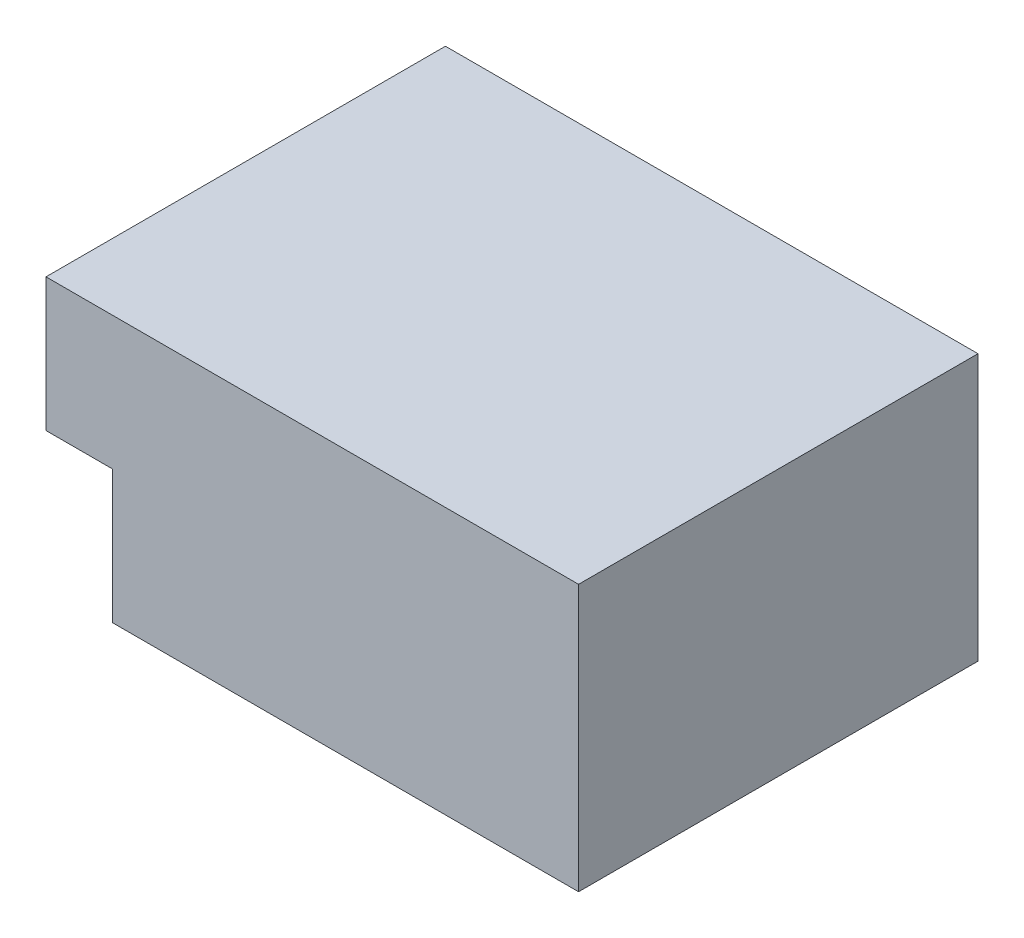
ISO-10303-21;
HEADER;
FILE_DESCRIPTION(('STEP AP214'),'2;1');
FILE_NAME('part.step','',(''),(''),'','','');
FILE_SCHEMA(('AUTOMOTIVE_DESIGN { 1 0 10303 214 1 1 1 1 }'));
ENDSEC;
DATA;
#1=APPLICATION_CONTEXT('core data for automotive mechanical design processes');
#2=APPLICATION_PROTOCOL_DEFINITION('international standard','automotive_design',2000,#1);
#3=PRODUCT_CONTEXT('',#1,'mechanical');
#4=PRODUCT('Part','Part','',(#3));
#5=PRODUCT_RELATED_PRODUCT_CATEGORY('part','',(#4));
#6=PRODUCT_DEFINITION_FORMATION('','',#4);
#7=PRODUCT_DEFINITION_CONTEXT('part definition',#1,'design');
#8=PRODUCT_DEFINITION('design','',#6,#7);
#9=PRODUCT_DEFINITION_SHAPE('','',#8);
#10=(LENGTH_UNIT() NAMED_UNIT(*) SI_UNIT(.MILLI.,.METRE.));
#11=(NAMED_UNIT(*) PLANE_ANGLE_UNIT() SI_UNIT($,.RADIAN.));
#12=(NAMED_UNIT(*) SI_UNIT($,.STERADIAN.) SOLID_ANGLE_UNIT());
#13=UNCERTAINTY_MEASURE_WITH_UNIT(LENGTH_MEASURE(1.E-05),#10,'distance_accuracy_value','');
#14=(GEOMETRIC_REPRESENTATION_CONTEXT(3) GLOBAL_UNCERTAINTY_ASSIGNED_CONTEXT((#13)) GLOBAL_UNIT_ASSIGNED_CONTEXT((#10,
#11,#12)) REPRESENTATION_CONTEXT('',''));
#15=CARTESIAN_POINT('',(0.,0.,0.));
#16=DIRECTION('',(0.,0.,1.));
#17=DIRECTION('',(1.,0.,0.));
#18=AXIS2_PLACEMENT_3D('',#15,#16,#17);
#19=CARTESIAN_POINT('',(0.,0.,0.));
#20=DIRECTION('',(0.,-1.,0.));
#21=DIRECTION('',(-1.,0.,0.));
#22=AXIS2_PLACEMENT_3D('',#19,#20,#21);
#23=PLANE('',#22);
#24=DIRECTION('',(0.,0.,-1.));
#25=VECTOR('',#24,1.);
#26=CARTESIAN_POINT('',(-1.95,0.,-1.05));
#27=LINE('',#26,#25);
#28=CARTESIAN_POINT('',(-1.95,0.,-1.05));
#29=VERTEX_POINT('',#28);
#30=CARTESIAN_POINT('',(-1.95,0.,-1.35));
#31=VERTEX_POINT('',#30);
#32=EDGE_CURVE('E11',#29,#31,#27,.T.);
#33=ORIENTED_EDGE('',*,*,#32,.T.);
#34=DIRECTION('',(1.,0.,0.));
#35=VECTOR('',#34,1.);
#36=CARTESIAN_POINT('',(-1.95,0.,-1.35));
#37=LINE('',#36,#35);
#38=CARTESIAN_POINT('',(-1.6,0.,-1.35));
#39=VERTEX_POINT('',#38);
#40=EDGE_CURVE('E115',#31,#39,#37,.T.);
#41=ORIENTED_EDGE('',*,*,#40,.T.);
#42=DIRECTION('',(0.,0.,-1.));
#43=VECTOR('',#42,1.);
#44=CARTESIAN_POINT('',(-1.6,0.,-1.05));
#45=LINE('',#44,#43);
#46=CARTESIAN_POINT('',(-1.6,0.,-1.05));
#47=VERTEX_POINT('',#46);
#48=EDGE_CURVE('E109',#47,#39,#45,.T.);
#49=ORIENTED_EDGE('',*,*,#48,.F.);
#50=DIRECTION('',(-1.,0.,0.));
#51=VECTOR('',#50,1.);
#52=CARTESIAN_POINT('',(-1.6,0.,-1.05));
#53=LINE('',#52,#51);
#54=EDGE_CURVE('E101',#47,#29,#53,.T.);
#55=ORIENTED_EDGE('',*,*,#54,.T.);
#56=EDGE_LOOP('',(#33,#41,#49,#55));
#57=FACE_BOUND('',#56,.T.);
#58=ADVANCED_FACE('F17',(#57),#23,.T.);
#59=CARTESIAN_POINT('',(-1.75,0.,-1.05));
#60=DIRECTION('',(0.,0.,-1.));
#61=DIRECTION('',(-1.,0.,0.));
#62=AXIS2_PLACEMENT_3D('',#59,#60,#61);
#63=PLANE('',#62);
#64=DIRECTION('',(0.,1.,0.));
#65=VECTOR('',#64,1.);
#66=CARTESIAN_POINT('',(-2.,0.1,-1.05));
#67=LINE('',#66,#65);
#68=CARTESIAN_POINT('',(-2.,0.1,-1.05));
#69=VERTEX_POINT('',#68);
#70=CARTESIAN_POINT('',(-2.,0.2,-1.05));
#71=VERTEX_POINT('',#70);
#72=EDGE_CURVE('E24',#69,#71,#67,.T.);
#73=ORIENTED_EDGE('',*,*,#72,.F.);
#74=DIRECTION('',(1.,0.,0.));
#75=VECTOR('',#74,1.);
#76=CARTESIAN_POINT('',(-2.,0.1,-1.05));
#77=LINE('',#76,#75);
#78=CARTESIAN_POINT('',(-1.95,0.1,-1.05));
#79=VERTEX_POINT('',#78);
#80=EDGE_CURVE('E85',#69,#79,#77,.T.);
#81=ORIENTED_EDGE('',*,*,#80,.T.);
#82=DIRECTION('',(0.,1.,0.));
#83=VECTOR('',#82,1.);
#84=CARTESIAN_POINT('',(-1.95,0.,-1.05));
#85=LINE('',#84,#83);
#86=EDGE_CURVE('E103',#29,#79,#85,.T.);
#87=ORIENTED_EDGE('',*,*,#86,.F.);
#88=ORIENTED_EDGE('',*,*,#54,.F.);
#89=DIRECTION('',(0.,1.,0.));
#90=VECTOR('',#89,1.);
#91=CARTESIAN_POINT('',(-1.6,0.,-1.05));
#92=LINE('',#91,#90);
#93=CARTESIAN_POINT('',(-1.6,0.2,-1.05));
#94=VERTEX_POINT('',#93);
#95=EDGE_CURVE('E80',#47,#94,#92,.T.);
#96=ORIENTED_EDGE('',*,*,#95,.T.);
#97=DIRECTION('',(-1.,0.,0.));
#98=VECTOR('',#97,1.);
#99=CARTESIAN_POINT('',(-1.6,0.2,-1.05));
#100=LINE('',#99,#98);
#101=EDGE_CURVE('E79',#94,#71,#100,.T.);
#102=ORIENTED_EDGE('',*,*,#101,.T.);
#103=EDGE_LOOP('',(#73,#81,#87,#88,#96,#102));
#104=FACE_BOUND('',#103,.T.);
#105=ADVANCED_FACE('F117',(#104),#63,.F.);
#106=CARTESIAN_POINT('',(0.,0.2,0.));
#107=DIRECTION('',(0.,-1.,0.));
#108=DIRECTION('',(-1.,0.,0.));
#109=AXIS2_PLACEMENT_3D('',#106,#107,#108);
#110=PLANE('',#109);
#111=DIRECTION('',(1.,0.,0.));
#112=VECTOR('',#111,1.);
#113=CARTESIAN_POINT('',(-2.,0.2,-1.35));
#114=LINE('',#113,#112);
#115=CARTESIAN_POINT('',(-2.,0.2,-1.35));
#116=VERTEX_POINT('',#115);
#117=CARTESIAN_POINT('',(-1.6,0.2,-1.35));
#118=VERTEX_POINT('',#117);
#119=EDGE_CURVE('E113',#116,#118,#114,.T.);
#120=ORIENTED_EDGE('',*,*,#119,.F.);
#121=DIRECTION('',(0.,0.,-1.));
#122=VECTOR('',#121,1.);
#123=CARTESIAN_POINT('',(-2.,0.2,-1.05));
#124=LINE('',#123,#122);
#125=EDGE_CURVE('E91',#71,#116,#124,.T.);
#126=ORIENTED_EDGE('',*,*,#125,.F.);
#127=ORIENTED_EDGE('',*,*,#101,.F.);
#128=DIRECTION('',(0.,0.,1.));
#129=VECTOR('',#128,1.);
#130=CARTESIAN_POINT('',(-1.6,0.2,-1.35));
#131=LINE('',#130,#129);
#132=EDGE_CURVE('E98',#118,#94,#131,.T.);
#133=ORIENTED_EDGE('',*,*,#132,.F.);
#134=EDGE_LOOP('',(#120,#126,#127,#133));
#135=FACE_BOUND('',#134,.T.);
#136=ADVANCED_FACE('F122',(#135),#110,.F.);
#137=CARTESIAN_POINT('',(-1.6,0.,-1.05));
#138=DIRECTION('',(1.,0.,0.));
#139=DIRECTION('',(0.,0.,-1.));
#140=AXIS2_PLACEMENT_3D('',#137,#138,#139);
#141=PLANE('',#140);
#142=DIRECTION('',(0.,1.,0.));
#143=VECTOR('',#142,1.);
#144=CARTESIAN_POINT('',(-1.6,0.,-1.35));
#145=LINE('',#144,#143);
#146=EDGE_CURVE('E107',#39,#118,#145,.T.);
#147=ORIENTED_EDGE('',*,*,#146,.T.);
#148=ORIENTED_EDGE('',*,*,#132,.T.);
#149=ORIENTED_EDGE('',*,*,#95,.F.);
#150=ORIENTED_EDGE('',*,*,#48,.T.);
#151=EDGE_LOOP('',(#147,#148,#149,#150));
#152=FACE_BOUND('',#151,.T.);
#153=ADVANCED_FACE('F125',(#152),#141,.T.);
#154=CARTESIAN_POINT('',(-2.,0.,-1.35));
#155=DIRECTION('',(0.,0.,1.));
#156=DIRECTION('',(1.,0.,0.));
#157=AXIS2_PLACEMENT_3D('',#154,#155,#156);
#158=PLANE('',#157);
#159=DIRECTION('',(0.,1.,0.));
#160=VECTOR('',#159,1.);
#161=CARTESIAN_POINT('',(-1.95,0.,-1.35));
#162=LINE('',#161,#160);
#163=CARTESIAN_POINT('',(-1.95,0.1,-1.35));
#164=VERTEX_POINT('',#163);
#165=EDGE_CURVE('E75',#31,#164,#162,.T.);
#166=ORIENTED_EDGE('',*,*,#165,.T.);
#167=DIRECTION('',(1.,0.,0.));
#168=VECTOR('',#167,1.);
#169=CARTESIAN_POINT('',(-2.,0.1,-1.35));
#170=LINE('',#169,#168);
#171=CARTESIAN_POINT('',(-2.,0.1,-1.35));
#172=VERTEX_POINT('',#171);
#173=EDGE_CURVE('E68',#172,#164,#170,.T.);
#174=ORIENTED_EDGE('',*,*,#173,.F.);
#175=DIRECTION('',(0.,1.,0.));
#176=VECTOR('',#175,1.);
#177=CARTESIAN_POINT('',(-2.,0.1,-1.35));
#178=LINE('',#177,#176);
#179=EDGE_CURVE('E73',#172,#116,#178,.T.);
#180=ORIENTED_EDGE('',*,*,#179,.T.);
#181=ORIENTED_EDGE('',*,*,#119,.T.);
#182=ORIENTED_EDGE('',*,*,#146,.F.);
#183=ORIENTED_EDGE('',*,*,#40,.F.);
#184=EDGE_LOOP('',(#166,#174,#180,#181,#182,#183));
#185=FACE_BOUND('',#184,.T.);
#186=ADVANCED_FACE('F70',(#185),#158,.F.);
#187=CARTESIAN_POINT('',(-2.,0.,-1.05));
#188=DIRECTION('',(1.,0.,0.));
#189=DIRECTION('',(0.,0.,-1.));
#190=AXIS2_PLACEMENT_3D('',#187,#188,#189);
#191=PLANE('',#190);
#192=ORIENTED_EDGE('',*,*,#72,.T.);
#193=ORIENTED_EDGE('',*,*,#125,.T.);
#194=ORIENTED_EDGE('',*,*,#179,.F.);
#195=DIRECTION('',(0.,0.,-1.));
#196=VECTOR('',#195,1.);
#197=CARTESIAN_POINT('',(-2.,0.1,-1.05));
#198=LINE('',#197,#196);
#199=EDGE_CURVE('E83',#69,#172,#198,.T.);
#200=ORIENTED_EDGE('',*,*,#199,.F.);
#201=EDGE_LOOP('',(#192,#193,#194,#200));
#202=FACE_BOUND('',#201,.T.);
#203=ADVANCED_FACE('F90',(#202),#191,.F.);
#204=CARTESIAN_POINT('',(-2.,0.1,-1.92));
#205=DIRECTION('',(0.,-1.,0.));
#206=DIRECTION('',(1.,0.,0.));
#207=AXIS2_PLACEMENT_3D('',#204,#205,#206);
#208=PLANE('',#207);
#209=ORIENTED_EDGE('',*,*,#80,.F.);
#210=ORIENTED_EDGE('',*,*,#199,.T.);
#211=ORIENTED_EDGE('',*,*,#173,.T.);
#212=DIRECTION('',(0.,0.,1.));
#213=VECTOR('',#212,1.);
#214=CARTESIAN_POINT('',(-1.95,0.1,-1.35));
#215=LINE('',#214,#213);
#216=EDGE_CURVE('E87',#164,#79,#215,.T.);
#217=ORIENTED_EDGE('',*,*,#216,.T.);
#218=EDGE_LOOP('',(#209,#210,#211,#217));
#219=FACE_BOUND('',#218,.T.);
#220=ADVANCED_FACE('F84',(#219),#208,.T.);
#221=CARTESIAN_POINT('',(-1.95,0.1,-1.92));
#222=DIRECTION('',(-1.,0.,0.));
#223=DIRECTION('',(0.,-1.,0.));
#224=AXIS2_PLACEMENT_3D('',#221,#222,#223);
#225=PLANE('',#224);
#226=ORIENTED_EDGE('',*,*,#165,.F.);
#227=ORIENTED_EDGE('',*,*,#32,.F.);
#228=ORIENTED_EDGE('',*,*,#86,.T.);
#229=ORIENTED_EDGE('',*,*,#216,.F.);
#230=EDGE_LOOP('',(#226,#227,#228,#229));
#231=FACE_BOUND('',#230,.T.);
#232=ADVANCED_FACE('F127',(#231),#225,.T.);
#233=CLOSED_SHELL('',(#58,#105,#136,#153,#186,#203,#220,#232));
#234=MANIFOLD_SOLID_BREP('B1',#233);
#235=ADVANCED_BREP_SHAPE_REPRESENTATION('',(#18,#234),#14);
#236=SHAPE_DEFINITION_REPRESENTATION(#9,#235);
ENDSEC;
END-ISO-10303-21;
